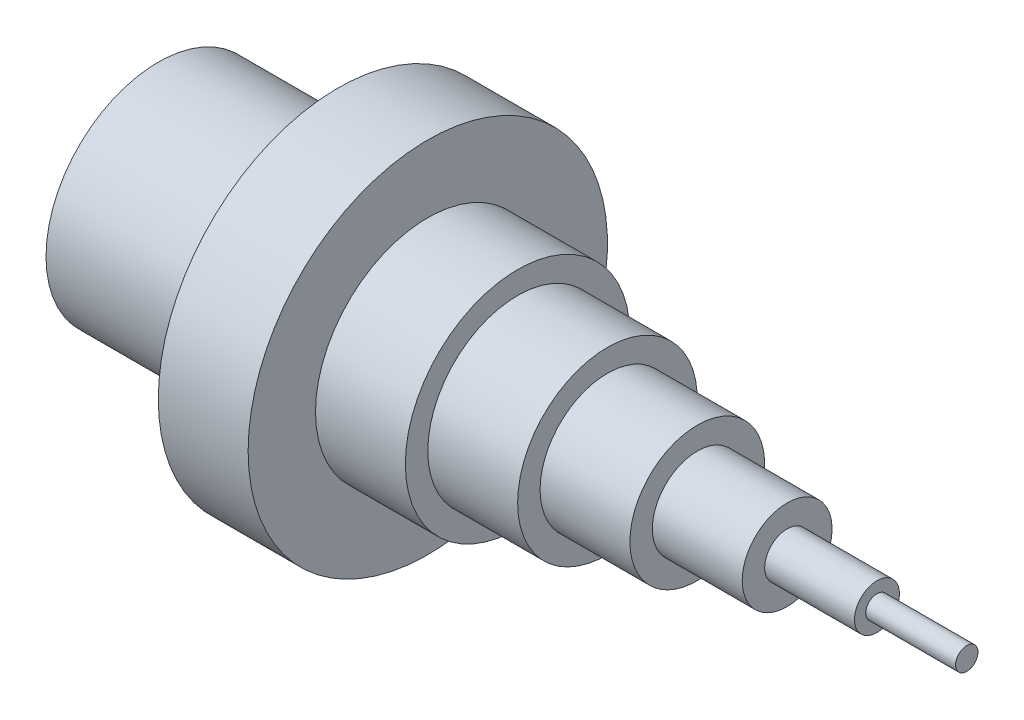
ISO-10303-21;
HEADER;
FILE_DESCRIPTION(('STEP AP214'),'2;1');
FILE_NAME('part.step','',(''),(''),'','','');
FILE_SCHEMA(('AUTOMOTIVE_DESIGN { 1 0 10303 214 1 1 1 1 }'));
ENDSEC;
DATA;
#1=APPLICATION_CONTEXT('core data for automotive mechanical design processes');
#2=APPLICATION_PROTOCOL_DEFINITION('international standard','automotive_design',2000,#1);
#3=PRODUCT_CONTEXT('',#1,'mechanical');
#4=PRODUCT('Part','Part','',(#3));
#5=PRODUCT_RELATED_PRODUCT_CATEGORY('part','',(#4));
#6=PRODUCT_DEFINITION_FORMATION('','',#4);
#7=PRODUCT_DEFINITION_CONTEXT('part definition',#1,'design');
#8=PRODUCT_DEFINITION('design','',#6,#7);
#9=PRODUCT_DEFINITION_SHAPE('','',#8);
#10=(LENGTH_UNIT() NAMED_UNIT(*) SI_UNIT(.MILLI.,.METRE.));
#11=(NAMED_UNIT(*) PLANE_ANGLE_UNIT() SI_UNIT($,.RADIAN.));
#12=(NAMED_UNIT(*) SI_UNIT($,.STERADIAN.) SOLID_ANGLE_UNIT());
#13=UNCERTAINTY_MEASURE_WITH_UNIT(LENGTH_MEASURE(1.E-05),#10,'distance_accuracy_value','');
#14=(GEOMETRIC_REPRESENTATION_CONTEXT(3) GLOBAL_UNCERTAINTY_ASSIGNED_CONTEXT((#13)) GLOBAL_UNIT_ASSIGNED_CONTEXT((#10,
#11,#12)) REPRESENTATION_CONTEXT('',''));
#15=CARTESIAN_POINT('',(0.,0.,0.));
#16=DIRECTION('',(0.,0.,1.));
#17=DIRECTION('',(1.,0.,0.));
#18=AXIS2_PLACEMENT_3D('',#15,#16,#17);
#19=CARTESIAN_POINT('',(1016.,-635.,0.));
#20=DIRECTION('',(-1.,0.,0.));
#21=DIRECTION('',(0.,0.,1.));
#22=AXIS2_PLACEMENT_3D('',#19,#20,#21);
#23=PLANE('',#22);
#24=CARTESIAN_POINT('',(1016.,0.,0.));
#25=DIRECTION('',(-1.,0.,0.));
#26=DIRECTION('',(0.,0.,1.));
#27=AXIS2_PLACEMENT_3D('',#24,#25,#26);
#28=CIRCLE('',#27,1016.);
#29=CARTESIAN_POINT('',(1016.,0.,1016.));
#30=VERTEX_POINT('',#29);
#31=EDGE_CURVE('E10',#30,#30,#28,.T.);
#32=ORIENTED_EDGE('',*,*,#31,.T.);
#33=EDGE_LOOP('',(#32));
#34=FACE_BOUND('',#33,.T.);
#35=CARTESIAN_POINT('',(1016.,0.,0.));
#36=DIRECTION('',(-1.,0.,0.));
#37=DIRECTION('',(0.,0.,1.));
#38=AXIS2_PLACEMENT_3D('',#35,#36,#37);
#39=CIRCLE('',#38,635.);
#40=CARTESIAN_POINT('',(1016.,0.,635.));
#41=VERTEX_POINT('',#40);
#42=EDGE_CURVE('E82',#41,#41,#39,.T.);
#43=ORIENTED_EDGE('',*,*,#42,.F.);
#44=EDGE_LOOP('',(#43));
#45=FACE_BOUND('',#44,.T.);
#46=ADVANCED_FACE('F30',(#34,#45),#23,.T.);
#47=CARTESIAN_POINT('',(0.,0.,0.));
#48=DIRECTION('',(-1.,0.,0.));
#49=DIRECTION('',(0.,0.,1.));
#50=AXIS2_PLACEMENT_3D('',#47,#48,#49);
#51=CYLINDRICAL_SURFACE('',#50,1016.);
#52=CARTESIAN_POINT('',(1524.,0.,0.));
#53=DIRECTION('',(-1.,0.,0.));
#54=DIRECTION('',(0.,0.,1.));
#55=AXIS2_PLACEMENT_3D('',#52,#53,#54);
#56=CIRCLE('',#55,1016.);
#57=CARTESIAN_POINT('',(1524.,0.,1016.));
#58=VERTEX_POINT('',#57);
#59=EDGE_CURVE('E36',#58,#58,#56,.T.);
#60=ORIENTED_EDGE('',*,*,#59,.T.);
#61=EDGE_LOOP('',(#60));
#62=FACE_BOUND('',#61,.T.);
#63=ORIENTED_EDGE('',*,*,#31,.F.);
#64=EDGE_LOOP('',(#63));
#65=FACE_BOUND('',#64,.T.);
#66=ADVANCED_FACE('F114',(#62,#65),#51,.T.);
#67=CARTESIAN_POINT('',(1524.,-1016.,0.));
#68=DIRECTION('',(1.,0.,0.));
#69=DIRECTION('',(0.,0.,-1.));
#70=AXIS2_PLACEMENT_3D('',#67,#68,#69);
#71=PLANE('',#70);
#72=CARTESIAN_POINT('',(1524.,0.,0.));
#73=DIRECTION('',(-1.,0.,0.));
#74=DIRECTION('',(0.,0.,1.));
#75=AXIS2_PLACEMENT_3D('',#72,#73,#74);
#76=CIRCLE('',#75,635.);
#77=CARTESIAN_POINT('',(1524.,0.,635.));
#78=VERTEX_POINT('',#77);
#79=EDGE_CURVE('E40',#78,#78,#76,.T.);
#80=ORIENTED_EDGE('',*,*,#79,.T.);
#81=EDGE_LOOP('',(#80));
#82=FACE_BOUND('',#81,.T.);
#83=ORIENTED_EDGE('',*,*,#59,.F.);
#84=EDGE_LOOP('',(#83));
#85=FACE_BOUND('',#84,.T.);
#86=ADVANCED_FACE('F118',(#82,#85),#71,.T.);
#87=CARTESIAN_POINT('',(0.,0.,0.));
#88=DIRECTION('',(-1.,0.,0.));
#89=DIRECTION('',(0.,0.,1.));
#90=AXIS2_PLACEMENT_3D('',#87,#88,#89);
#91=CYLINDRICAL_SURFACE('',#90,635.);
#92=CARTESIAN_POINT('',(2032.,0.,0.));
#93=DIRECTION('',(-1.,0.,0.));
#94=DIRECTION('',(0.,0.,1.));
#95=AXIS2_PLACEMENT_3D('',#92,#93,#94);
#96=CIRCLE('',#95,635.);
#97=CARTESIAN_POINT('',(2032.,0.,635.));
#98=VERTEX_POINT('',#97);
#99=EDGE_CURVE('E44',#98,#98,#96,.T.);
#100=ORIENTED_EDGE('',*,*,#99,.T.);
#101=EDGE_LOOP('',(#100));
#102=FACE_BOUND('',#101,.T.);
#103=ORIENTED_EDGE('',*,*,#79,.F.);
#104=EDGE_LOOP('',(#103));
#105=FACE_BOUND('',#104,.T.);
#106=ADVANCED_FACE('F124',(#102,#105),#91,.T.);
#107=CARTESIAN_POINT('',(2032.,-635.,0.));
#108=DIRECTION('',(1.,0.,0.));
#109=DIRECTION('',(0.,0.,-1.));
#110=AXIS2_PLACEMENT_3D('',#107,#108,#109);
#111=PLANE('',#110);
#112=CARTESIAN_POINT('',(2032.,0.,0.));
#113=DIRECTION('',(-1.,0.,0.));
#114=DIRECTION('',(0.,0.,1.));
#115=AXIS2_PLACEMENT_3D('',#112,#113,#114);
#116=CIRCLE('',#115,508.);
#117=CARTESIAN_POINT('',(2032.,0.,508.));
#118=VERTEX_POINT('',#117);
#119=EDGE_CURVE('E49',#118,#118,#116,.T.);
#120=ORIENTED_EDGE('',*,*,#119,.T.);
#121=EDGE_LOOP('',(#120));
#122=FACE_BOUND('',#121,.T.);
#123=ORIENTED_EDGE('',*,*,#99,.F.);
#124=EDGE_LOOP('',(#123));
#125=FACE_BOUND('',#124,.T.);
#126=ADVANCED_FACE('F131',(#122,#125),#111,.T.);
#127=CARTESIAN_POINT('',(0.,0.,0.));
#128=DIRECTION('',(-1.,0.,0.));
#129=DIRECTION('',(0.,0.,1.));
#130=AXIS2_PLACEMENT_3D('',#127,#128,#129);
#131=CYLINDRICAL_SURFACE('',#130,508.);
#132=CARTESIAN_POINT('',(2540.,0.,0.));
#133=DIRECTION('',(-1.,0.,0.));
#134=DIRECTION('',(0.,0.,1.));
#135=AXIS2_PLACEMENT_3D('',#132,#133,#134);
#136=CIRCLE('',#135,508.);
#137=CARTESIAN_POINT('',(2540.,0.,508.));
#138=VERTEX_POINT('',#137);
#139=EDGE_CURVE('E52',#138,#138,#136,.T.);
#140=ORIENTED_EDGE('',*,*,#139,.T.);
#141=EDGE_LOOP('',(#140));
#142=FACE_BOUND('',#141,.T.);
#143=ORIENTED_EDGE('',*,*,#119,.F.);
#144=EDGE_LOOP('',(#143));
#145=FACE_BOUND('',#144,.T.);
#146=ADVANCED_FACE('F135',(#142,#145),#131,.T.);
#147=CARTESIAN_POINT('',(2540.,-508.,0.));
#148=DIRECTION('',(1.,0.,0.));
#149=DIRECTION('',(0.,0.,-1.));
#150=AXIS2_PLACEMENT_3D('',#147,#148,#149);
#151=PLANE('',#150);
#152=CARTESIAN_POINT('',(2540.,0.,0.));
#153=DIRECTION('',(-1.,0.,0.));
#154=DIRECTION('',(0.,0.,1.));
#155=AXIS2_PLACEMENT_3D('',#152,#153,#154);
#156=CIRCLE('',#155,381.);
#157=CARTESIAN_POINT('',(2540.,0.,381.));
#158=VERTEX_POINT('',#157);
#159=EDGE_CURVE('E55',#158,#158,#156,.T.);
#160=ORIENTED_EDGE('',*,*,#159,.T.);
#161=EDGE_LOOP('',(#160));
#162=FACE_BOUND('',#161,.T.);
#163=ORIENTED_EDGE('',*,*,#139,.F.);
#164=EDGE_LOOP('',(#163));
#165=FACE_BOUND('',#164,.T.);
#166=ADVANCED_FACE('F139',(#162,#165),#151,.T.);
#167=CARTESIAN_POINT('',(0.,0.,0.));
#168=DIRECTION('',(-1.,0.,0.));
#169=DIRECTION('',(0.,0.,1.));
#170=AXIS2_PLACEMENT_3D('',#167,#168,#169);
#171=CYLINDRICAL_SURFACE('',#170,381.);
#172=CARTESIAN_POINT('',(3048.,0.,0.));
#173=DIRECTION('',(-1.,0.,0.));
#174=DIRECTION('',(0.,0.,1.));
#175=AXIS2_PLACEMENT_3D('',#172,#173,#174);
#176=CIRCLE('',#175,381.);
#177=CARTESIAN_POINT('',(3048.,0.,381.));
#178=VERTEX_POINT('',#177);
#179=EDGE_CURVE('E58',#178,#178,#176,.T.);
#180=ORIENTED_EDGE('',*,*,#179,.T.);
#181=EDGE_LOOP('',(#180));
#182=FACE_BOUND('',#181,.T.);
#183=ORIENTED_EDGE('',*,*,#159,.F.);
#184=EDGE_LOOP('',(#183));
#185=FACE_BOUND('',#184,.T.);
#186=ADVANCED_FACE('F143',(#182,#185),#171,.T.);
#187=CARTESIAN_POINT('',(3048.,-381.,0.));
#188=DIRECTION('',(1.,0.,0.));
#189=DIRECTION('',(0.,0.,-1.));
#190=AXIS2_PLACEMENT_3D('',#187,#188,#189);
#191=PLANE('',#190);
#192=CARTESIAN_POINT('',(3048.,0.,0.));
#193=DIRECTION('',(-1.,0.,0.));
#194=DIRECTION('',(0.,0.,1.));
#195=AXIS2_PLACEMENT_3D('',#192,#193,#194);
#196=CIRCLE('',#195,254.);
#197=CARTESIAN_POINT('',(3048.,0.,254.));
#198=VERTEX_POINT('',#197);
#199=EDGE_CURVE('E61',#198,#198,#196,.T.);
#200=ORIENTED_EDGE('',*,*,#199,.T.);
#201=EDGE_LOOP('',(#200));
#202=FACE_BOUND('',#201,.T.);
#203=ORIENTED_EDGE('',*,*,#179,.F.);
#204=EDGE_LOOP('',(#203));
#205=FACE_BOUND('',#204,.T.);
#206=ADVANCED_FACE('F147',(#202,#205),#191,.T.);
#207=CARTESIAN_POINT('',(0.,0.,0.));
#208=DIRECTION('',(-1.,0.,0.));
#209=DIRECTION('',(0.,0.,1.));
#210=AXIS2_PLACEMENT_3D('',#207,#208,#209);
#211=CYLINDRICAL_SURFACE('',#210,254.);
#212=CARTESIAN_POINT('',(3556.,0.,0.));
#213=DIRECTION('',(-1.,0.,0.));
#214=DIRECTION('',(0.,0.,1.));
#215=AXIS2_PLACEMENT_3D('',#212,#213,#214);
#216=CIRCLE('',#215,254.);
#217=CARTESIAN_POINT('',(3556.,0.,254.));
#218=VERTEX_POINT('',#217);
#219=EDGE_CURVE('E64',#218,#218,#216,.T.);
#220=ORIENTED_EDGE('',*,*,#219,.T.);
#221=EDGE_LOOP('',(#220));
#222=FACE_BOUND('',#221,.T.);
#223=ORIENTED_EDGE('',*,*,#199,.F.);
#224=EDGE_LOOP('',(#223));
#225=FACE_BOUND('',#224,.T.);
#226=ADVANCED_FACE('F151',(#222,#225),#211,.T.);
#227=CARTESIAN_POINT('',(3556.,-254.,0.));
#228=DIRECTION('',(1.,0.,0.));
#229=DIRECTION('',(0.,0.,-1.));
#230=AXIS2_PLACEMENT_3D('',#227,#228,#229);
#231=PLANE('',#230);
#232=CARTESIAN_POINT('',(3556.,0.,0.));
#233=DIRECTION('',(-1.,0.,0.));
#234=DIRECTION('',(0.,0.,1.));
#235=AXIS2_PLACEMENT_3D('',#232,#233,#234);
#236=CIRCLE('',#235,127.);
#237=CARTESIAN_POINT('',(3556.,0.,127.));
#238=VERTEX_POINT('',#237);
#239=EDGE_CURVE('E67',#238,#238,#236,.T.);
#240=ORIENTED_EDGE('',*,*,#239,.T.);
#241=EDGE_LOOP('',(#240));
#242=FACE_BOUND('',#241,.T.);
#243=ORIENTED_EDGE('',*,*,#219,.F.);
#244=EDGE_LOOP('',(#243));
#245=FACE_BOUND('',#244,.T.);
#246=ADVANCED_FACE('F155',(#242,#245),#231,.T.);
#247=CARTESIAN_POINT('',(0.,0.,0.));
#248=DIRECTION('',(-1.,0.,0.));
#249=DIRECTION('',(0.,0.,1.));
#250=AXIS2_PLACEMENT_3D('',#247,#248,#249);
#251=CYLINDRICAL_SURFACE('',#250,127.);
#252=CARTESIAN_POINT('',(4064.,0.,0.));
#253=DIRECTION('',(-1.,0.,0.));
#254=DIRECTION('',(0.,0.,1.));
#255=AXIS2_PLACEMENT_3D('',#252,#253,#254);
#256=CIRCLE('',#255,127.);
#257=CARTESIAN_POINT('',(4064.,0.,127.));
#258=VERTEX_POINT('',#257);
#259=EDGE_CURVE('E70',#258,#258,#256,.T.);
#260=ORIENTED_EDGE('',*,*,#259,.T.);
#261=EDGE_LOOP('',(#260));
#262=FACE_BOUND('',#261,.T.);
#263=ORIENTED_EDGE('',*,*,#239,.F.);
#264=EDGE_LOOP('',(#263));
#265=FACE_BOUND('',#264,.T.);
#266=ADVANCED_FACE('F159',(#262,#265),#251,.T.);
#267=CARTESIAN_POINT('',(4064.,-127.,0.));
#268=DIRECTION('',(1.,0.,0.));
#269=DIRECTION('',(0.,0.,-1.));
#270=AXIS2_PLACEMENT_3D('',#267,#268,#269);
#271=PLANE('',#270);
#272=CARTESIAN_POINT('',(4064.,0.,0.));
#273=DIRECTION('',(-1.,0.,0.));
#274=DIRECTION('',(0.,0.,1.));
#275=AXIS2_PLACEMENT_3D('',#272,#273,#274);
#276=CIRCLE('',#275,63.5);
#277=CARTESIAN_POINT('',(4064.,0.,63.5));
#278=VERTEX_POINT('',#277);
#279=EDGE_CURVE('E73',#278,#278,#276,.T.);
#280=ORIENTED_EDGE('',*,*,#279,.T.);
#281=EDGE_LOOP('',(#280));
#282=FACE_BOUND('',#281,.T.);
#283=ORIENTED_EDGE('',*,*,#259,.F.);
#284=EDGE_LOOP('',(#283));
#285=FACE_BOUND('',#284,.T.);
#286=ADVANCED_FACE('F163',(#282,#285),#271,.T.);
#287=CARTESIAN_POINT('',(0.,0.,0.));
#288=DIRECTION('',(-1.,0.,0.));
#289=DIRECTION('',(0.,0.,1.));
#290=AXIS2_PLACEMENT_3D('',#287,#288,#289);
#291=CYLINDRICAL_SURFACE('',#290,63.5);
#292=CARTESIAN_POINT('',(4572.,0.,0.));
#293=DIRECTION('',(-1.,0.,0.));
#294=DIRECTION('',(0.,0.,1.));
#295=AXIS2_PLACEMENT_3D('',#292,#293,#294);
#296=CIRCLE('',#295,63.5);
#297=CARTESIAN_POINT('',(4572.,0.,63.5));
#298=VERTEX_POINT('',#297);
#299=EDGE_CURVE('E76',#298,#298,#296,.T.);
#300=ORIENTED_EDGE('',*,*,#299,.T.);
#301=EDGE_LOOP('',(#300));
#302=FACE_BOUND('',#301,.T.);
#303=ORIENTED_EDGE('',*,*,#279,.F.);
#304=EDGE_LOOP('',(#303));
#305=FACE_BOUND('',#304,.T.);
#306=ADVANCED_FACE('F167',(#302,#305),#291,.T.);
#307=CARTESIAN_POINT('',(4572.,-63.5,0.));
#308=DIRECTION('',(1.,0.,0.));
#309=DIRECTION('',(0.,0.,-1.));
#310=AXIS2_PLACEMENT_3D('',#307,#308,#309);
#311=PLANE('',#310);
#312=ORIENTED_EDGE('',*,*,#299,.F.);
#313=EDGE_LOOP('',(#312));
#314=FACE_BOUND('',#313,.T.);
#315=ADVANCED_FACE('F104',(#314),#311,.T.);
#316=CARTESIAN_POINT('',(0.,0.,0.));
#317=DIRECTION('',(-1.,0.,0.));
#318=DIRECTION('',(0.,0.,1.));
#319=AXIS2_PLACEMENT_3D('',#316,#317,#318);
#320=PLANE('',#319);
#321=CARTESIAN_POINT('',(0.,0.,0.));
#322=DIRECTION('',(-1.,0.,0.));
#323=DIRECTION('',(0.,0.,1.));
#324=AXIS2_PLACEMENT_3D('',#321,#322,#323);
#325=CIRCLE('',#324,508.);
#326=CARTESIAN_POINT('',(0.,0.,508.));
#327=VERTEX_POINT('',#326);
#328=EDGE_CURVE('E86',#327,#327,#325,.T.);
#329=ORIENTED_EDGE('',*,*,#328,.F.);
#330=EDGE_LOOP('',(#329));
#331=FACE_BOUND('',#330,.T.);
#332=CARTESIAN_POINT('',(0.,0.,0.));
#333=DIRECTION('',(-1.,0.,0.));
#334=DIRECTION('',(0.,0.,1.));
#335=AXIS2_PLACEMENT_3D('',#332,#333,#334);
#336=CIRCLE('',#335,635.);
#337=CARTESIAN_POINT('',(0.,0.,635.));
#338=VERTEX_POINT('',#337);
#339=EDGE_CURVE('E79',#338,#338,#336,.T.);
#340=ORIENTED_EDGE('',*,*,#339,.T.);
#341=EDGE_LOOP('',(#340));
#342=FACE_BOUND('',#341,.T.);
#343=ADVANCED_FACE('F101',(#331,#342),#320,.T.);
#344=CARTESIAN_POINT('',(0.,0.,0.));
#345=DIRECTION('',(-1.,0.,0.));
#346=DIRECTION('',(0.,0.,1.));
#347=AXIS2_PLACEMENT_3D('',#344,#345,#346);
#348=CYLINDRICAL_SURFACE('',#347,635.);
#349=ORIENTED_EDGE('',*,*,#42,.T.);
#350=EDGE_LOOP('',(#349));
#351=FACE_BOUND('',#350,.T.);
#352=ORIENTED_EDGE('',*,*,#339,.F.);
#353=EDGE_LOOP('',(#352));
#354=FACE_BOUND('',#353,.T.);
#355=ADVANCED_FACE('F97',(#351,#354),#348,.T.);
#356=CARTESIAN_POINT('',(1016.,0.,0.));
#357=DIRECTION('',(-1.,0.,0.));
#358=DIRECTION('',(0.,0.,1.));
#359=AXIS2_PLACEMENT_3D('',#356,#357,#358);
#360=CYLINDRICAL_SURFACE('',#359,508.);
#361=CARTESIAN_POINT('',(1016.,0.,0.));
#362=DIRECTION('',(-1.,0.,0.));
#363=DIRECTION('',(0.,0.,1.));
#364=AXIS2_PLACEMENT_3D('',#361,#362,#363);
#365=CIRCLE('',#364,508.);
#366=CARTESIAN_POINT('',(1016.,0.,508.));
#367=VERTEX_POINT('',#366);
#368=EDGE_CURVE('E85',#367,#367,#365,.T.);
#369=ORIENTED_EDGE('',*,*,#368,.F.);
#370=EDGE_LOOP('',(#369));
#371=FACE_BOUND('',#370,.T.);
#372=ORIENTED_EDGE('',*,*,#328,.T.);
#373=EDGE_LOOP('',(#372));
#374=FACE_BOUND('',#373,.T.);
#375=ADVANCED_FACE('F94',(#371,#374),#360,.F.);
#376=CARTESIAN_POINT('',(1016.,0.,0.));
#377=DIRECTION('',(-1.,0.,0.));
#378=DIRECTION('',(0.,0.,1.));
#379=AXIS2_PLACEMENT_3D('',#376,#377,#378);
#380=PLANE('',#379);
#381=ORIENTED_EDGE('',*,*,#368,.T.);
#382=EDGE_LOOP('',(#381));
#383=FACE_BOUND('',#382,.T.);
#384=ADVANCED_FACE('F92',(#383),#380,.T.);
#385=CLOSED_SHELL('',(#46,#66,#86,#106,#126,#146,#166,#186,#206,#226,#246,#266,#286,#306,#315,
#343,#355,#375,#384));
#386=MANIFOLD_SOLID_BREP('B2',#385);
#387=ADVANCED_BREP_SHAPE_REPRESENTATION('',(#18,#386),#14);
#388=SHAPE_DEFINITION_REPRESENTATION(#9,#387);
ENDSEC;
END-ISO-10303-21;
